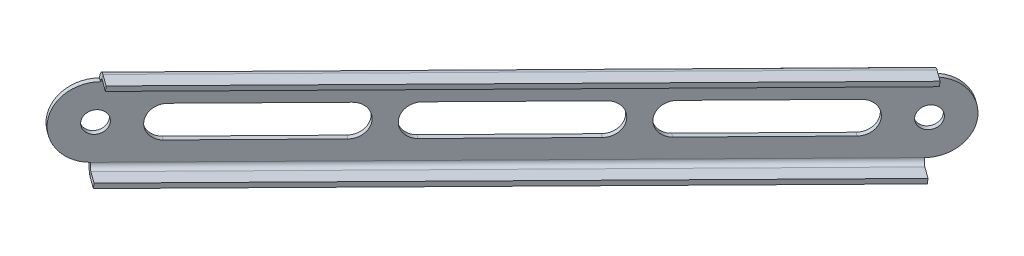
ISO-10303-21;
HEADER;
FILE_DESCRIPTION(('STEP AP214'),'2;1');
FILE_NAME('part.step','',(''),(''),'','','');
FILE_SCHEMA(('AUTOMOTIVE_DESIGN { 1 0 10303 214 1 1 1 1 }'));
ENDSEC;
DATA;
#1=APPLICATION_CONTEXT('core data for automotive mechanical design processes');
#2=APPLICATION_PROTOCOL_DEFINITION('international standard','automotive_design',2000,#1);
#3=PRODUCT_CONTEXT('',#1,'mechanical');
#4=PRODUCT('Part','Part','',(#3));
#5=PRODUCT_RELATED_PRODUCT_CATEGORY('part','',(#4));
#6=PRODUCT_DEFINITION_FORMATION('','',#4);
#7=PRODUCT_DEFINITION_CONTEXT('part definition',#1,'design');
#8=PRODUCT_DEFINITION('design','',#6,#7);
#9=PRODUCT_DEFINITION_SHAPE('','',#8);
#10=(LENGTH_UNIT() NAMED_UNIT(*) SI_UNIT(.MILLI.,.METRE.));
#11=(NAMED_UNIT(*) PLANE_ANGLE_UNIT() SI_UNIT($,.RADIAN.));
#12=(NAMED_UNIT(*) SI_UNIT($,.STERADIAN.) SOLID_ANGLE_UNIT());
#13=UNCERTAINTY_MEASURE_WITH_UNIT(LENGTH_MEASURE(1.E-05),#10,'distance_accuracy_value','');
#14=(GEOMETRIC_REPRESENTATION_CONTEXT(3) GLOBAL_UNCERTAINTY_ASSIGNED_CONTEXT((#13)) GLOBAL_UNIT_ASSIGNED_CONTEXT((#10,
#11,#12)) REPRESENTATION_CONTEXT('',''));
#15=CARTESIAN_POINT('',(0.,0.,0.));
#16=DIRECTION('',(0.,0.,1.));
#17=DIRECTION('',(1.,0.,0.));
#18=AXIS2_PLACEMENT_3D('',#15,#16,#17);
#19=CARTESIAN_POINT('',(46.1946672147795,292.349027374514,185.048223614894));
#20=DIRECTION('',(0.809016994374949,0.,0.587785252292471));
#21=DIRECTION('',(-0.587785252292471,0.,0.809016994374949));
#22=AXIS2_PLACEMENT_3D('',#19,#20,#21);
#23=CYLINDRICAL_SURFACE('',#22,5.00000000000003);
#24=DIRECTION('',(0.809016994374949,0.,0.587785252292471));
#25=VECTOR('',#24,1.);
#26=CARTESIAN_POINT('',(46.4979226401542,297.322337873893,184.630828330124));
#27=LINE('',#26,#25);
#28=CARTESIAN_POINT('',(45.2843971485918,297.322337873893,183.749150451685));
#29=VERTEX_POINT('',#28);
#30=CARTESIAN_POINT('',(46.4979226401542,297.322337873893,184.630828330124));
#31=VERTEX_POINT('',#30);
#32=EDGE_CURVE('E11',#29,#31,#27,.T.);
#33=ORIENTED_EDGE('',*,*,#32,.T.);
#34=CARTESIAN_POINT('',(46.1946672147795,292.349027374514,185.048223614894));
#35=DIRECTION('',(-0.809016994374949,0.,-0.587785252292471));
#36=DIRECTION('',(-0.587785252292471,0.,0.809016994374949));
#37=AXIS2_PLACEMENT_3D('',#34,#35,#36);
#38=CIRCLE('',#37,5.00000000000003);
#39=CARTESIAN_POINT('',(45.8914117894049,287.375716875136,185.465618899665));
#40=VERTEX_POINT('',#39);
#41=EDGE_CURVE('E149',#40,#31,#38,.T.);
#42=ORIENTED_EDGE('',*,*,#41,.F.);
#43=DIRECTION('',(0.809016994374949,0.,0.587785252292471));
#44=VECTOR('',#43,1.);
#45=CARTESIAN_POINT('',(45.8914117894049,287.375716875136,185.465618899665));
#46=LINE('',#45,#44);
#47=CARTESIAN_POINT('',(44.6778862978425,287.375716875136,184.583941021226));
#48=VERTEX_POINT('',#47);
#49=EDGE_CURVE('E44',#48,#40,#46,.T.);
#50=ORIENTED_EDGE('',*,*,#49,.F.);
#51=CARTESIAN_POINT('',(44.9811417232171,292.349027374514,184.166545736456));
#52=DIRECTION('',(-0.809016994374949,0.,-0.587785252292471));
#53=DIRECTION('',(-0.587785252292471,0.,0.809016994374949));
#54=AXIS2_PLACEMENT_3D('',#51,#52,#53);
#55=CIRCLE('',#54,5.00000000000003);
#56=EDGE_CURVE('E109',#48,#29,#55,.T.);
#57=ORIENTED_EDGE('',*,*,#56,.T.);
#58=EDGE_LOOP('',(#33,#42,#50,#57));
#59=FACE_BOUND('',#58,.T.);
#60=ADVANCED_FACE('F34',(#59),#23,.F.);
#61=CARTESIAN_POINT('',(70.4777787273767,283.036413709116,151.62538795617));
#62=DIRECTION('',(0.0606510850749327,0.994662099875776,-0.0834790569540966));
#63=DIRECTION('',(-0.584647713321243,0.10318578909284,0.804698542460175));
#64=AXIS2_PLACEMENT_3D('',#61,#62,#63);
#65=PLANE('',#64);
#66=ORIENTED_EDGE('',*,*,#49,.T.);
#67=DIRECTION('',(-0.584647713321243,0.10318578909284,0.804698542460175));
#68=VECTOR('',#67,1.);
#69=CARTESIAN_POINT('',(70.4777787273767,283.036413709116,151.62538795617));
#70=LINE('',#69,#68);
#71=CARTESIAN_POINT('',(70.4777787273767,283.036413709116,151.62538795617));
#72=VERTEX_POINT('',#71);
#73=EDGE_CURVE('E146',#72,#40,#70,.T.);
#74=ORIENTED_EDGE('',*,*,#73,.F.);
#75=DIRECTION('',(0.809016994374949,0.,0.587785252292471));
#76=VECTOR('',#75,1.);
#77=CARTESIAN_POINT('',(70.4777787273767,283.036413709116,151.62538795617));
#78=LINE('',#77,#76);
#79=CARTESIAN_POINT('',(69.2642532358143,283.036413709116,150.743710077731));
#80=VERTEX_POINT('',#79);
#81=EDGE_CURVE('E120',#80,#72,#78,.T.);
#82=ORIENTED_EDGE('',*,*,#81,.F.);
#83=DIRECTION('',(-0.584647713321243,0.10318578909284,0.804698542460175));
#84=VECTOR('',#83,1.);
#85=CARTESIAN_POINT('',(69.2642532358143,283.036413709116,150.743710077731));
#86=LINE('',#85,#84);
#87=EDGE_CURVE('E114',#80,#48,#86,.T.);
#88=ORIENTED_EDGE('',*,*,#87,.T.);
#89=EDGE_LOOP('',(#66,#74,#82,#88));
#90=FACE_BOUND('',#89,.T.);
#91=ADVANCED_FACE('F145',(#90),#65,.T.);
#92=CARTESIAN_POINT('',(70.7810341527513,288.009724208495,151.2079926714));
#93=DIRECTION('',(0.809016994374949,0.,0.587785252292471));
#94=DIRECTION('',(-0.587785252292471,0.,0.809016994374949));
#95=AXIS2_PLACEMENT_3D('',#92,#93,#94);
#96=CYLINDRICAL_SURFACE('',#95,4.99999999999989);
#97=ORIENTED_EDGE('',*,*,#81,.T.);
#98=CARTESIAN_POINT('',(70.7810341527513,288.009724208495,151.2079926714));
#99=DIRECTION('',(-0.809016994374949,0.,-0.587785252292471));
#100=DIRECTION('',(-0.587785252292471,0.,0.809016994374949));
#101=AXIS2_PLACEMENT_3D('',#98,#99,#100);
#102=CIRCLE('',#101,4.99999999999989);
#103=CARTESIAN_POINT('',(71.084289578126,292.983034707874,150.790597386629));
#104=VERTEX_POINT('',#103);
#105=EDGE_CURVE('E52',#104,#72,#102,.T.);
#106=ORIENTED_EDGE('',*,*,#105,.F.);
#107=DIRECTION('',(0.809016994374949,0.,0.587785252292471));
#108=VECTOR('',#107,1.);
#109=CARTESIAN_POINT('',(71.084289578126,292.983034707874,150.790597386629));
#110=LINE('',#109,#108);
#111=CARTESIAN_POINT('',(69.8707640865636,292.983034707874,149.90891950819));
#112=VERTEX_POINT('',#111);
#113=EDGE_CURVE('E38',#112,#104,#110,.T.);
#114=ORIENTED_EDGE('',*,*,#113,.F.);
#115=CARTESIAN_POINT('',(69.5675086611889,288.009724208495,150.326314792961));
#116=DIRECTION('',(-0.809016994374949,0.,-0.587785252292471));
#117=DIRECTION('',(-0.587785252292471,0.,0.809016994374949));
#118=AXIS2_PLACEMENT_3D('',#115,#116,#117);
#119=CIRCLE('',#118,4.99999999999989);
#120=EDGE_CURVE('E110',#112,#80,#119,.T.);
#121=ORIENTED_EDGE('',*,*,#120,.T.);
#122=EDGE_LOOP('',(#97,#106,#114,#121));
#123=FACE_BOUND('',#122,.T.);
#124=ADVANCED_FACE('F119',(#123),#96,.F.);
#125=CARTESIAN_POINT('',(114.076127917003,280.368475791505,91.6174083691793));
#126=DIRECTION('',(0.809016994374949,0.,0.587785252292471));
#127=DIRECTION('',(-0.587785252292471,0.,0.809016994374949));
#128=AXIS2_PLACEMENT_3D('',#125,#126,#127);
#129=CYLINDRICAL_SURFACE('',#128,5.00000000000003);
#130=DIRECTION('',(0.809016994374949,0.,0.587785252292471));
#131=VECTOR('',#130,1.);
#132=CARTESIAN_POINT('',(114.379383342378,285.341786290884,91.2000130844088));
#133=LINE('',#132,#131);
#134=CARTESIAN_POINT('',(113.165857850815,285.341786290884,90.3183352059701));
#135=VERTEX_POINT('',#134);
#136=CARTESIAN_POINT('',(114.379383342378,285.341786290884,91.2000130844088));
#137=VERTEX_POINT('',#136);
#138=EDGE_CURVE('E121',#135,#137,#133,.T.);
#139=ORIENTED_EDGE('',*,*,#138,.T.);
#140=CARTESIAN_POINT('',(114.076127917003,280.368475791505,91.6174083691793));
#141=DIRECTION('',(-0.809016994374949,0.,-0.587785252292471));
#142=DIRECTION('',(-0.587785252292471,0.,0.809016994374949));
#143=AXIS2_PLACEMENT_3D('',#140,#141,#142);
#144=CIRCLE('',#143,5.00000000000003);
#145=CARTESIAN_POINT('',(113.772872491628,275.395165292126,92.0348036539498));
#146=VERTEX_POINT('',#145);
#147=EDGE_CURVE('E238',#146,#137,#144,.T.);
#148=ORIENTED_EDGE('',*,*,#147,.F.);
#149=DIRECTION('',(0.809016994374949,0.,0.587785252292471));
#150=VECTOR('',#149,1.);
#151=CARTESIAN_POINT('',(113.772872491628,275.395165292126,92.0348036539498));
#152=LINE('',#151,#150);
#153=CARTESIAN_POINT('',(112.559347000066,275.395165292126,91.1531257755111));
#154=VERTEX_POINT('',#153);
#155=EDGE_CURVE('E124',#154,#146,#152,.T.);
#156=ORIENTED_EDGE('',*,*,#155,.F.);
#157=CARTESIAN_POINT('',(112.86260242544,280.368475791505,90.7357304907406));
#158=DIRECTION('',(-0.809016994374949,0.,-0.587785252292471));
#159=DIRECTION('',(-0.587785252292471,0.,0.809016994374949));
#160=AXIS2_PLACEMENT_3D('',#157,#158,#159);
#161=CIRCLE('',#160,5.00000000000003);
#162=EDGE_CURVE('E189',#154,#135,#161,.T.);
#163=ORIENTED_EDGE('',*,*,#162,.T.);
#164=EDGE_LOOP('',(#139,#148,#156,#163));
#165=FACE_BOUND('',#164,.T.);
#166=ADVANCED_FACE('F464',(#165),#129,.F.);
#167=CARTESIAN_POINT('',(138.3592394296,271.055862126107,58.1945727104551));
#168=DIRECTION('',(0.060651085074935,0.994662099875775,-0.0834790569540998));
#169=DIRECTION('',(-0.584647713321242,0.103185789092844,0.804698542460175));
#170=AXIS2_PLACEMENT_3D('',#167,#168,#169);
#171=PLANE('',#170);
#172=ORIENTED_EDGE('',*,*,#155,.T.);
#173=DIRECTION('',(-0.584647713321242,0.103185789092844,0.804698542460175));
#174=VECTOR('',#173,1.);
#175=CARTESIAN_POINT('',(138.3592394296,271.055862126107,58.1945727104551));
#176=LINE('',#175,#174);
#177=CARTESIAN_POINT('',(138.3592394296,271.055862126107,58.1945727104551));
#178=VERTEX_POINT('',#177);
#179=EDGE_CURVE('E233',#178,#146,#176,.T.);
#180=ORIENTED_EDGE('',*,*,#179,.F.);
#181=DIRECTION('',(0.809016994374949,0.,0.587785252292471));
#182=VECTOR('',#181,1.);
#183=CARTESIAN_POINT('',(138.3592394296,271.055862126107,58.1945727104551));
#184=LINE('',#183,#182);
#185=CARTESIAN_POINT('',(137.145713938038,271.055862126107,57.3128948320164));
#186=VERTEX_POINT('',#185);
#187=EDGE_CURVE('E132',#186,#178,#184,.T.);
#188=ORIENTED_EDGE('',*,*,#187,.F.);
#189=DIRECTION('',(-0.584647713321242,0.103185789092844,0.804698542460175));
#190=VECTOR('',#189,1.);
#191=CARTESIAN_POINT('',(137.145713938038,271.055862126107,57.3128948320164));
#192=LINE('',#191,#190);
#193=EDGE_CURVE('E117',#186,#154,#192,.T.);
#194=ORIENTED_EDGE('',*,*,#193,.T.);
#195=EDGE_LOOP('',(#172,#180,#188,#194));
#196=FACE_BOUND('',#195,.T.);
#197=ADVANCED_FACE('F234',(#196),#171,.T.);
#198=CARTESIAN_POINT('',(138.662494854975,276.029172625486,57.7771774256846));
#199=DIRECTION('',(0.809016994374949,0.,0.587785252292471));
#200=DIRECTION('',(-0.587785252292471,0.,0.809016994374949));
#201=AXIS2_PLACEMENT_3D('',#198,#199,#200);
#202=CYLINDRICAL_SURFACE('',#201,5.00000000000006);
#203=ORIENTED_EDGE('',*,*,#187,.T.);
#204=CARTESIAN_POINT('',(138.662494854975,276.029172625486,57.7771774256846));
#205=DIRECTION('',(-0.809016994374949,0.,-0.587785252292471));
#206=DIRECTION('',(-0.587785252292471,0.,0.809016994374949));
#207=AXIS2_PLACEMENT_3D('',#204,#205,#206);
#208=CIRCLE('',#207,5.00000000000006);
#209=CARTESIAN_POINT('',(138.965750280349,281.002483124865,57.3597821409141));
#210=VERTEX_POINT('',#209);
#211=EDGE_CURVE('E226',#210,#178,#208,.T.);
#212=ORIENTED_EDGE('',*,*,#211,.F.);
#213=DIRECTION('',(0.809016994374949,0.,0.587785252292471));
#214=VECTOR('',#213,1.);
#215=CARTESIAN_POINT('',(138.965750280349,281.002483124865,57.3597821409141));
#216=LINE('',#215,#214);
#217=CARTESIAN_POINT('',(137.752224788787,281.002483124865,56.4781042624754));
#218=VERTEX_POINT('',#217);
#219=EDGE_CURVE('E136',#218,#210,#216,.T.);
#220=ORIENTED_EDGE('',*,*,#219,.F.);
#221=CARTESIAN_POINT('',(137.448969363412,276.029172625486,56.8954995472459));
#222=DIRECTION('',(-0.809016994374949,0.,-0.587785252292471));
#223=DIRECTION('',(-0.587785252292471,0.,0.809016994374949));
#224=AXIS2_PLACEMENT_3D('',#221,#222,#223);
#225=CIRCLE('',#224,5.00000000000006);
#226=EDGE_CURVE('E185',#218,#186,#225,.T.);
#227=ORIENTED_EDGE('',*,*,#226,.T.);
#228=EDGE_LOOP('',(#203,#212,#220,#227));
#229=FACE_BOUND('',#228,.T.);
#230=ADVANCED_FACE('F222',(#229),#202,.F.);
#231=CARTESIAN_POINT('',(148.016858268115,274.3782,44.9020007463218));
#232=DIRECTION('',(0.809016994374949,0.,0.587785252292471));
#233=DIRECTION('',(-0.587785252292471,0.,0.809016994374949));
#234=AXIS2_PLACEMENT_3D('',#231,#232,#233);
#235=CYLINDRICAL_SURFACE('',#234,11.);
#236=DIRECTION('',(0.809016994374949,0.,0.587785252292471));
#237=VECTOR('',#236,1.);
#238=CARTESIAN_POINT('',(148.684020203939,285.319483098633,43.9837311198267));
#239=LINE('',#238,#237);
#240=CARTESIAN_POINT('',(147.470494712377,285.319483098635,43.1020532413885));
#241=VERTEX_POINT('',#240);
#242=CARTESIAN_POINT('',(148.684020203939,285.319483098633,43.9837311198267));
#243=VERTEX_POINT('',#242);
#244=EDGE_CURVE('E138',#241,#243,#239,.T.);
#245=ORIENTED_EDGE('',*,*,#244,.T.);
#246=CARTESIAN_POINT('',(148.016858268115,274.3782,44.9020007463218));
#247=DIRECTION('',(-0.809016994374949,0.,-0.587785252292471));
#248=DIRECTION('',(-0.587785252292471,0.,0.809016994374949));
#249=AXIS2_PLACEMENT_3D('',#246,#247,#248);
#250=CIRCLE('',#249,11.);
#251=CARTESIAN_POINT('',(147.34969633229,263.436916901366,45.8202703728169));
#252=VERTEX_POINT('',#251);
#253=EDGE_CURVE('E252',#243,#252,#250,.T.);
#254=ORIENTED_EDGE('',*,*,#253,.T.);
#255=DIRECTION('',(0.809016994374949,0.,0.587785252292471));
#256=VECTOR('',#255,1.);
#257=CARTESIAN_POINT('',(147.34969633229,263.436916901366,45.8202703728169));
#258=LINE('',#257,#256);
#259=CARTESIAN_POINT('',(146.136170840728,263.436916901366,44.9385924943781));
#260=VERTEX_POINT('',#259);
#261=EDGE_CURVE('E210',#260,#252,#258,.T.);
#262=ORIENTED_EDGE('',*,*,#261,.F.);
#263=CARTESIAN_POINT('',(146.803332776552,274.3782,44.0203228678831));
#264=DIRECTION('',(-0.809016994374949,0.,-0.587785252292471));
#265=DIRECTION('',(-0.587785252292471,0.,0.809016994374949));
#266=AXIS2_PLACEMENT_3D('',#263,#264,#265);
#267=CIRCLE('',#266,11.);
#268=EDGE_CURVE('E178',#241,#260,#267,.T.);
#269=ORIENTED_EDGE('',*,*,#268,.F.);
#270=EDGE_LOOP('',(#245,#254,#262,#269));
#271=FACE_BOUND('',#270,.T.);
#272=ADVANCED_FACE('F475',(#271),#235,.T.);
#273=CARTESIAN_POINT('',(36.8403038016397,294.,197.923400294257));
#274=DIRECTION('',(0.809016994374949,0.,0.587785252292471));
#275=DIRECTION('',(-0.587785252292471,0.,0.809016994374949));
#276=AXIS2_PLACEMENT_3D('',#273,#274,#275);
#277=CYLINDRICAL_SURFACE('',#276,11.);
#278=DIRECTION('',(0.809016994374949,0.,0.587785252292471));
#279=VECTOR('',#278,1.);
#280=CARTESIAN_POINT('',(36.1731418658154,283.058716901366,198.841669920752));
#281=LINE('',#280,#279);
#282=CARTESIAN_POINT('',(34.9596163742536,283.058716901366,197.959992042314));
#283=VERTEX_POINT('',#282);
#284=CARTESIAN_POINT('',(36.1731418658154,283.058716901366,198.841669920752));
#285=VERTEX_POINT('',#284);
#286=EDGE_CURVE('E207',#283,#285,#281,.T.);
#287=ORIENTED_EDGE('',*,*,#286,.T.);
#288=CARTESIAN_POINT('',(36.8403038016397,294.,197.923400294257));
#289=DIRECTION('',(-0.809016994374949,0.,-0.587785252292471));
#290=DIRECTION('',(0.587785252292471,0.,-0.809016994374949));
#291=AXIS2_PLACEMENT_3D('',#288,#289,#290);
#292=CIRCLE('',#291,11.);
#293=CARTESIAN_POINT('',(37.507465737464,304.941283098634,197.005130667762));
#294=VERTEX_POINT('',#293);
#295=EDGE_CURVE('E258',#285,#294,#292,.T.);
#296=ORIENTED_EDGE('',*,*,#295,.T.);
#297=DIRECTION('',(0.809016994374949,0.,0.587785252292471));
#298=VECTOR('',#297,1.);
#299=CARTESIAN_POINT('',(37.507465737464,304.941283098634,197.005130667762));
#300=LINE('',#299,#298);
#301=CARTESIAN_POINT('',(36.2939402459015,304.941283098634,196.123452789323));
#302=VERTEX_POINT('',#301);
#303=EDGE_CURVE('E204',#302,#294,#300,.T.);
#304=ORIENTED_EDGE('',*,*,#303,.F.);
#305=CARTESIAN_POINT('',(35.6267783100772,294.,197.041722415818));
#306=DIRECTION('',(-0.809016994374949,0.,-0.587785252292471));
#307=DIRECTION('',(-0.587785252292471,0.,0.809016994374949));
#308=AXIS2_PLACEMENT_3D('',#305,#306,#307);
#309=CIRCLE('',#308,11.);
#310=EDGE_CURVE('E170',#283,#302,#309,.T.);
#311=ORIENTED_EDGE('',*,*,#310,.F.);
#312=EDGE_LOOP('',(#287,#296,#304,#311));
#313=FACE_BOUND('',#312,.T.);
#314=ADVANCED_FACE('F482',(#313),#277,.T.);
#315=CARTESIAN_POINT('',(80.1353975658912,286.35875158301,138.332815992037));
#316=DIRECTION('',(0.809016994374949,0.,0.587785252292471));
#317=DIRECTION('',(-0.587785252292471,0.,0.809016994374949));
#318=AXIS2_PLACEMENT_3D('',#315,#316,#317);
#319=CYLINDRICAL_SURFACE('',#318,5.00000000000009);
#320=DIRECTION('',(0.809016994374949,0.,0.587785252292471));
#321=VECTOR('',#320,1.);
#322=CARTESIAN_POINT('',(80.4386529912658,291.332062082389,137.915420707266));
#323=LINE('',#322,#321);
#324=CARTESIAN_POINT('',(79.2251274997034,291.332062082389,137.033742828828));
#325=VERTEX_POINT('',#324);
#326=CARTESIAN_POINT('',(80.4386529912658,291.332062082389,137.915420707266));
#327=VERTEX_POINT('',#326);
#328=EDGE_CURVE('E201',#325,#327,#323,.T.);
#329=ORIENTED_EDGE('',*,*,#328,.T.);
#330=CARTESIAN_POINT('',(80.1353975658912,286.35875158301,138.332815992037));
#331=DIRECTION('',(-0.809016994374949,0.,-0.587785252292471));
#332=DIRECTION('',(-0.587785252292471,0.,0.809016994374949));
#333=AXIS2_PLACEMENT_3D('',#330,#331,#332);
#334=CIRCLE('',#333,5.00000000000009);
#335=CARTESIAN_POINT('',(79.8321421405165,281.385441083631,138.750211276807));
#336=VERTEX_POINT('',#335);
#337=EDGE_CURVE('E267',#336,#327,#334,.T.);
#338=ORIENTED_EDGE('',*,*,#337,.F.);
#339=DIRECTION('',(0.809016994374949,0.,0.587785252292471));
#340=VECTOR('',#339,1.);
#341=CARTESIAN_POINT('',(79.8321421405165,281.385441083631,138.750211276807));
#342=LINE('',#341,#340);
#343=CARTESIAN_POINT('',(78.6186166489541,281.385441083631,137.868533398369));
#344=VERTEX_POINT('',#343);
#345=EDGE_CURVE('E198',#344,#336,#342,.T.);
#346=ORIENTED_EDGE('',*,*,#345,.F.);
#347=CARTESIAN_POINT('',(78.9218720743288,286.35875158301,137.451138113598));
#348=DIRECTION('',(-0.809016994374949,0.,-0.587785252292471));
#349=DIRECTION('',(-0.587785252292471,0.,0.809016994374949));
#350=AXIS2_PLACEMENT_3D('',#347,#348,#349);
#351=CIRCLE('',#350,5.00000000000009);
#352=EDGE_CURVE('E164',#344,#325,#351,.T.);
#353=ORIENTED_EDGE('',*,*,#352,.T.);
#354=EDGE_LOOP('',(#329,#338,#346,#353));
#355=FACE_BOUND('',#354,.T.);
#356=ADVANCED_FACE('F486',(#355),#319,.F.);
#357=CARTESIAN_POINT('',(104.418509078488,277.046137917611,104.909980333313));
#358=DIRECTION('',(0.060651085074935,0.994662099875776,-0.0834790569540998));
#359=DIRECTION('',(-0.584647713321242,0.103185789092844,0.804698542460175));
#360=AXIS2_PLACEMENT_3D('',#357,#358,#359);
#361=PLANE('',#360);
#362=ORIENTED_EDGE('',*,*,#345,.T.);
#363=DIRECTION('',(-0.584647713321242,0.103185789092844,0.804698542460175));
#364=VECTOR('',#363,1.);
#365=CARTESIAN_POINT('',(104.418509078488,277.046137917611,104.909980333313));
#366=LINE('',#365,#364);
#367=CARTESIAN_POINT('',(104.418509078488,277.046137917611,104.909980333313));
#368=VERTEX_POINT('',#367);
#369=EDGE_CURVE('E264',#368,#336,#366,.T.);
#370=ORIENTED_EDGE('',*,*,#369,.F.);
#371=DIRECTION('',(0.809016994374949,0.,0.587785252292471));
#372=VECTOR('',#371,1.);
#373=CARTESIAN_POINT('',(104.418509078488,277.046137917611,104.909980333313));
#374=LINE('',#373,#372);
#375=CARTESIAN_POINT('',(103.204983586926,277.046137917611,104.028302454874));
#376=VERTEX_POINT('',#375);
#377=EDGE_CURVE('E195',#376,#368,#374,.T.);
#378=ORIENTED_EDGE('',*,*,#377,.F.);
#379=DIRECTION('',(-0.584647713321242,0.103185789092844,0.804698542460175));
#380=VECTOR('',#379,1.);
#381=CARTESIAN_POINT('',(103.204983586926,277.046137917611,104.028302454874));
#382=LINE('',#381,#380);
#383=EDGE_CURVE('E161',#376,#344,#382,.T.);
#384=ORIENTED_EDGE('',*,*,#383,.T.);
#385=EDGE_LOOP('',(#362,#370,#378,#384));
#386=FACE_BOUND('',#385,.T.);
#387=ADVANCED_FACE('F498',(#386),#361,.T.);
#388=CARTESIAN_POINT('',(104.721764503863,282.01944841699,104.492585048542));
#389=DIRECTION('',(0.809016994374949,0.,0.587785252292471));
#390=DIRECTION('',(-0.587785252292471,0.,0.809016994374949));
#391=AXIS2_PLACEMENT_3D('',#388,#389,#390);
#392=CYLINDRICAL_SURFACE('',#391,5.00000000000011);
#393=ORIENTED_EDGE('',*,*,#377,.T.);
#394=CARTESIAN_POINT('',(104.721764503863,282.01944841699,104.492585048542));
#395=DIRECTION('',(-0.809016994374949,0.,-0.587785252292471));
#396=DIRECTION('',(-0.587785252292471,0.,0.809016994374949));
#397=AXIS2_PLACEMENT_3D('',#394,#395,#396);
#398=CIRCLE('',#397,5.00000000000011);
#399=CARTESIAN_POINT('',(105.025019929238,286.992758916369,104.075189763772));
#400=VERTEX_POINT('',#399);
#401=EDGE_CURVE('E193',#400,#368,#398,.T.);
#402=ORIENTED_EDGE('',*,*,#401,.F.);
#403=DIRECTION('',(0.809016994374949,0.,0.587785252292471));
#404=VECTOR('',#403,1.);
#405=CARTESIAN_POINT('',(105.025019929238,286.992758916369,104.075189763772));
#406=LINE('',#405,#404);
#407=CARTESIAN_POINT('',(103.811494437675,286.992758916369,103.193511885333));
#408=VERTEX_POINT('',#407);
#409=EDGE_CURVE('E152',#408,#400,#406,.T.);
#410=ORIENTED_EDGE('',*,*,#409,.F.);
#411=CARTESIAN_POINT('',(103.508239012301,282.01944841699,103.610907170103));
#412=DIRECTION('',(-0.809016994374949,0.,-0.587785252292471));
#413=DIRECTION('',(-0.587785252292471,0.,0.809016994374949));
#414=AXIS2_PLACEMENT_3D('',#411,#412,#413);
#415=CIRCLE('',#414,5.00000000000011);
#416=EDGE_CURVE('E157',#408,#376,#415,.T.);
#417=ORIENTED_EDGE('',*,*,#416,.T.);
#418=EDGE_LOOP('',(#393,#402,#410,#417));
#419=FACE_BOUND('',#418,.T.);
#420=ADVANCED_FACE('F494',(#419),#392,.F.);
#421=CARTESIAN_POINT('',(105.025019929238,286.992758916369,104.075189763772));
#422=DIRECTION('',(-0.0606510850749342,-0.994662099875776,0.0834790569540987));
#423=DIRECTION('',(0.584647713321242,-0.103185789092842,-0.804698542460175));
#424=AXIS2_PLACEMENT_3D('',#421,#422,#423);
#425=PLANE('',#424);
#426=DIRECTION('',(0.584647713321242,-0.103185789092842,-0.804698542460175));
#427=VECTOR('',#426,1.);
#428=CARTESIAN_POINT('',(103.811494437675,286.992758916369,103.193511885333));
#429=LINE('',#428,#427);
#430=EDGE_CURVE('E159',#325,#408,#429,.T.);
#431=ORIENTED_EDGE('',*,*,#430,.T.);
#432=ORIENTED_EDGE('',*,*,#409,.T.);
#433=DIRECTION('',(0.584647713321242,-0.103185789092842,-0.804698542460175));
#434=VECTOR('',#433,1.);
#435=CARTESIAN_POINT('',(105.025019929238,286.992758916369,104.075189763772));
#436=LINE('',#435,#434);
#437=EDGE_CURVE('E270',#327,#400,#436,.T.);
#438=ORIENTED_EDGE('',*,*,#437,.F.);
#439=ORIENTED_EDGE('',*,*,#328,.F.);
#440=EDGE_LOOP('',(#431,#432,#438,#439));
#441=FACE_BOUND('',#440,.T.);
#442=ADVANCED_FACE('F490',(#441),#425,.T.);
#443=CARTESIAN_POINT('',(148.016858268115,274.3782,44.9020007463218));
#444=DIRECTION('',(0.809016994374949,0.,0.587785252292471));
#445=DIRECTION('',(-0.587785252292471,0.,0.809016994374949));
#446=AXIS2_PLACEMENT_3D('',#443,#444,#445);
#447=CYLINDRICAL_SURFACE('',#446,3.37820000000001);
#448=CARTESIAN_POINT('',(148.016858268115,274.3782,44.9020007463218));
#449=DIRECTION('',(-0.809016994374949,0.,-0.587785252292471));
#450=DIRECTION('',(-0.587785252292471,0.,0.809016994374949));
#451=AXIS2_PLACEMENT_3D('',#448,#449,#450);
#452=CIRCLE('',#451,3.37820000000001);
#453=CARTESIAN_POINT('',(146.03120212882,274.3782,47.6350219567192));
#454=VERTEX_POINT('',#453);
#455=EDGE_CURVE('E261',#454,#454,#452,.T.);
#456=ORIENTED_EDGE('',*,*,#455,.F.);
#457=EDGE_LOOP('',(#456));
#458=FACE_BOUND('',#457,.T.);
#459=CARTESIAN_POINT('',(146.803332776552,274.3782,44.0203228678831));
#460=DIRECTION('',(-0.809016994374949,0.,-0.587785252292471));
#461=DIRECTION('',(-0.587785252292471,0.,0.809016994374949));
#462=AXIS2_PLACEMENT_3D('',#459,#460,#461);
#463=CIRCLE('',#462,3.37820000000001);
#464=CARTESIAN_POINT('',(144.817676637258,274.3782,46.7533440782805));
#465=VERTEX_POINT('',#464);
#466=EDGE_CURVE('E163',#465,#465,#463,.T.);
#467=ORIENTED_EDGE('',*,*,#466,.T.);
#468=EDGE_LOOP('',(#467));
#469=FACE_BOUND('',#468,.T.);
#470=ADVANCED_FACE('F478',(#458,#469),#447,.F.);
#471=CARTESIAN_POINT('',(36.8403038016397,294.,197.923400294257));
#472=DIRECTION('',(0.809016994374949,0.,0.587785252292471));
#473=DIRECTION('',(-0.587785252292471,0.,0.809016994374949));
#474=AXIS2_PLACEMENT_3D('',#471,#472,#473);
#475=CYLINDRICAL_SURFACE('',#474,3.37819999999997);
#476=CARTESIAN_POINT('',(36.8403038016397,294.,197.923400294257));
#477=DIRECTION('',(-0.809016994374949,0.,-0.587785252292471));
#478=DIRECTION('',(-0.587785252292471,0.,0.809016994374949));
#479=AXIS2_PLACEMENT_3D('',#476,#477,#478);
#480=CIRCLE('',#479,3.37819999999997);
#481=CARTESIAN_POINT('',(34.8546476623453,294.,200.656421504655));
#482=VERTEX_POINT('',#481);
#483=EDGE_CURVE('E246',#482,#482,#480,.T.);
#484=ORIENTED_EDGE('',*,*,#483,.F.);
#485=EDGE_LOOP('',(#484));
#486=FACE_BOUND('',#485,.T.);
#487=CARTESIAN_POINT('',(35.6267783100772,294.,197.041722415818));
#488=DIRECTION('',(-0.809016994374949,0.,-0.587785252292471));
#489=DIRECTION('',(-0.587785252292471,0.,0.809016994374949));
#490=AXIS2_PLACEMENT_3D('',#487,#488,#489);
#491=CIRCLE('',#490,3.37819999999997);
#492=CARTESIAN_POINT('',(33.6411221707828,294.,199.774743626216));
#493=VERTEX_POINT('',#492);
#494=EDGE_CURVE('E177',#493,#493,#491,.T.);
#495=ORIENTED_EDGE('',*,*,#494,.T.);
#496=EDGE_LOOP('',(#495));
#497=FACE_BOUND('',#496,.T.);
#498=ADVANCED_FACE('F467',(#486,#497),#475,.F.);
#499=CARTESIAN_POINT('',(138.965750280349,281.002483124865,57.3597821409141));
#500=DIRECTION('',(-0.0606510850749342,-0.994662099875776,0.0834790569540987));
#501=DIRECTION('',(0.584647713321242,-0.103185789092842,-0.804698542460175));
#502=AXIS2_PLACEMENT_3D('',#499,#500,#501);
#503=PLANE('',#502);
#504=DIRECTION('',(0.584647713321242,-0.103185789092842,-0.804698542460175));
#505=VECTOR('',#504,1.);
#506=CARTESIAN_POINT('',(137.752224788787,281.002483124865,56.4781042624754));
#507=LINE('',#506,#505);
#508=EDGE_CURVE('E187',#135,#218,#507,.T.);
#509=ORIENTED_EDGE('',*,*,#508,.T.);
#510=ORIENTED_EDGE('',*,*,#219,.T.);
#511=DIRECTION('',(0.584647713321242,-0.103185789092842,-0.804698542460175));
#512=VECTOR('',#511,1.);
#513=CARTESIAN_POINT('',(138.965750280349,281.002483124865,57.3597821409141));
#514=LINE('',#513,#512);
#515=EDGE_CURVE('E240',#137,#210,#514,.T.);
#516=ORIENTED_EDGE('',*,*,#515,.F.);
#517=ORIENTED_EDGE('',*,*,#138,.F.);
#518=EDGE_LOOP('',(#509,#510,#516,#517));
#519=FACE_BOUND('',#518,.T.);
#520=ADVANCED_FACE('F453',(#519),#503,.T.);
#521=CARTESIAN_POINT('',(71.084289578126,292.983034707874,150.790597386629));
#522=DIRECTION('',(-0.0606510850749366,-0.994662099875775,0.083479056954102));
#523=DIRECTION('',(0.584647713321242,-0.103185789092846,-0.804698542460174));
#524=AXIS2_PLACEMENT_3D('',#521,#522,#523);
#525=PLANE('',#524);
#526=DIRECTION('',(0.584647713321242,-0.103185789092846,-0.804698542460174));
#527=VECTOR('',#526,1.);
#528=CARTESIAN_POINT('',(69.8707640865636,292.983034707874,149.90891950819));
#529=LINE('',#528,#527);
#530=EDGE_CURVE('E101',#29,#112,#529,.T.);
#531=ORIENTED_EDGE('',*,*,#530,.T.);
#532=ORIENTED_EDGE('',*,*,#113,.T.);
#533=DIRECTION('',(0.584647713321242,-0.103185789092846,-0.804698542460174));
#534=VECTOR('',#533,1.);
#535=CARTESIAN_POINT('',(71.084289578126,292.983034707874,150.790597386629));
#536=LINE('',#535,#534);
#537=EDGE_CURVE('E150',#31,#104,#536,.T.);
#538=ORIENTED_EDGE('',*,*,#537,.F.);
#539=ORIENTED_EDGE('',*,*,#32,.F.);
#540=EDGE_LOOP('',(#531,#532,#538,#539));
#541=FACE_BOUND('',#540,.T.);
#542=ADVANCED_FACE('F36',(#541),#525,.T.);
#543=CARTESIAN_POINT('',(36.8403038016397,294.,197.923400294257));
#544=DIRECTION('',(-0.809016994374949,0.,-0.587785252292471));
#545=DIRECTION('',(0.587785252292471,0.,-0.809016994374949));
#546=AXIS2_PLACEMENT_3D('',#543,#544,#545);
#547=PLANE('',#546);
#548=ORIENTED_EDGE('',*,*,#401,.T.);
#549=ORIENTED_EDGE('',*,*,#369,.T.);
#550=ORIENTED_EDGE('',*,*,#337,.T.);
#551=ORIENTED_EDGE('',*,*,#437,.T.);
#552=EDGE_LOOP('',(#548,#549,#550,#551));
#553=FACE_BOUND('',#552,.T.);
#554=ORIENTED_EDGE('',*,*,#455,.T.);
#555=EDGE_LOOP('',(#554));
#556=FACE_BOUND('',#555,.T.);
#557=ORIENTED_EDGE('',*,*,#295,.F.);
#558=DIRECTION('',(-0.584647713321242,0.103185789092844,0.804698542460175));
#559=VECTOR('',#558,1.);
#560=CARTESIAN_POINT('',(36.1731418658154,283.058716901366,198.841669920752));
#561=LINE('',#560,#559);
#562=EDGE_CURVE('E249',#252,#285,#561,.T.);
#563=ORIENTED_EDGE('',*,*,#562,.F.);
#564=ORIENTED_EDGE('',*,*,#253,.F.);
#565=DIRECTION('',(0.584647713321242,-0.103185789092844,-0.804698542460175));
#566=VECTOR('',#565,1.);
#567=CARTESIAN_POINT('',(148.684020203939,285.319483098633,43.9837311198267));
#568=LINE('',#567,#566);
#569=EDGE_CURVE('E255',#294,#243,#568,.T.);
#570=ORIENTED_EDGE('',*,*,#569,.F.);
#571=EDGE_LOOP('',(#557,#563,#564,#570));
#572=FACE_BOUND('',#571,.T.);
#573=ORIENTED_EDGE('',*,*,#483,.T.);
#574=EDGE_LOOP('',(#573));
#575=FACE_BOUND('',#574,.T.);
#576=ORIENTED_EDGE('',*,*,#211,.T.);
#577=ORIENTED_EDGE('',*,*,#179,.T.);
#578=ORIENTED_EDGE('',*,*,#147,.T.);
#579=ORIENTED_EDGE('',*,*,#515,.T.);
#580=EDGE_LOOP('',(#576,#577,#578,#579));
#581=FACE_BOUND('',#580,.T.);
#582=ORIENTED_EDGE('',*,*,#105,.T.);
#583=ORIENTED_EDGE('',*,*,#73,.T.);
#584=ORIENTED_EDGE('',*,*,#41,.T.);
#585=ORIENTED_EDGE('',*,*,#537,.T.);
#586=EDGE_LOOP('',(#582,#583,#584,#585));
#587=FACE_BOUND('',#586,.T.);
#588=ADVANCED_FACE('F442',(#553,#556,#572,#575,#581,#587),#547,.F.);
#589=CARTESIAN_POINT('',(35.6267783100772,294.,197.041722415818));
#590=DIRECTION('',(-0.809016994374949,0.,-0.587785252292471));
#591=DIRECTION('',(0.587785252292471,0.,-0.809016994374949));
#592=AXIS2_PLACEMENT_3D('',#589,#590,#591);
#593=PLANE('',#592);
#594=ORIENTED_EDGE('',*,*,#416,.F.);
#595=ORIENTED_EDGE('',*,*,#430,.F.);
#596=ORIENTED_EDGE('',*,*,#352,.F.);
#597=ORIENTED_EDGE('',*,*,#383,.F.);
#598=EDGE_LOOP('',(#594,#595,#596,#597));
#599=FACE_BOUND('',#598,.T.);
#600=ORIENTED_EDGE('',*,*,#466,.F.);
#601=EDGE_LOOP('',(#600));
#602=FACE_BOUND('',#601,.T.);
#603=ORIENTED_EDGE('',*,*,#310,.T.);
#604=DIRECTION('',(0.584647713321242,-0.103185789092844,-0.804698542460175));
#605=VECTOR('',#604,1.);
#606=CARTESIAN_POINT('',(147.470494712376,285.319483098633,43.102053241388));
#607=LINE('',#606,#605);
#608=EDGE_CURVE('E173',#302,#241,#607,.T.);
#609=ORIENTED_EDGE('',*,*,#608,.T.);
#610=ORIENTED_EDGE('',*,*,#268,.T.);
#611=DIRECTION('',(-0.584647713321242,0.103185789092844,0.804698542460175));
#612=VECTOR('',#611,1.);
#613=CARTESIAN_POINT('',(34.9596163742529,283.058716901366,197.959992042314));
#614=LINE('',#613,#612);
#615=EDGE_CURVE('E174',#260,#283,#614,.T.);
#616=ORIENTED_EDGE('',*,*,#615,.T.);
#617=EDGE_LOOP('',(#603,#609,#610,#616));
#618=FACE_BOUND('',#617,.T.);
#619=ORIENTED_EDGE('',*,*,#494,.F.);
#620=EDGE_LOOP('',(#619));
#621=FACE_BOUND('',#620,.T.);
#622=ORIENTED_EDGE('',*,*,#226,.F.);
#623=ORIENTED_EDGE('',*,*,#508,.F.);
#624=ORIENTED_EDGE('',*,*,#162,.F.);
#625=ORIENTED_EDGE('',*,*,#193,.F.);
#626=EDGE_LOOP('',(#622,#623,#624,#625));
#627=FACE_BOUND('',#626,.T.);
#628=ORIENTED_EDGE('',*,*,#120,.F.);
#629=ORIENTED_EDGE('',*,*,#530,.F.);
#630=ORIENTED_EDGE('',*,*,#56,.F.);
#631=ORIENTED_EDGE('',*,*,#87,.F.);
#632=EDGE_LOOP('',(#628,#629,#630,#631));
#633=FACE_BOUND('',#632,.T.);
#634=ADVANCED_FACE('F113',(#599,#602,#618,#621,#627,#633),#593,.T.);
#635=CARTESIAN_POINT('',(38.7209912290266,304.941283098635,197.886808546201));
#636=DIRECTION('',(-0.58464771332124,0.103185789092858,0.804698542460175));
#637=DIRECTION('',(-0.809016994374949,0.,-0.58778525229247));
#638=AXIS2_PLACEMENT_3D('',#635,#636,#637);
#639=PLANE('',#638);
#640=DIRECTION('',(-0.0606510850749274,-0.994662099875775,0.0834790569541056));
#641=VECTOR('',#640,1.);
#642=CARTESIAN_POINT('',(38.9029444842512,307.925269398261,197.636371375338));
#643=LINE('',#642,#641);
#644=CARTESIAN_POINT('',(38.8119678566389,306.433276248447,197.76158996077));
#645=VERTEX_POINT('',#644);
#646=CARTESIAN_POINT('',(38.9029444842513,307.925269398261,197.636371375339));
#647=VERTEX_POINT('',#646);
#648=EDGE_CURVE('E287',#645,#647,#643,.F.);
#649=ORIENTED_EDGE('',*,*,#648,.T.);
#650=CARTESIAN_POINT('',(38.7209912290265,304.941283098635,197.886808546201));
#651=DIRECTION('',(-0.58464771332124,0.103185789092858,0.804698542460175));
#652=DIRECTION('',(0.809016994374949,0.,0.58778525229247));
#653=AXIS2_PLACEMENT_3D('',#650,#651,#652);
#654=CIRCLE('',#653,2.9999999999988);
#655=EDGE_CURVE('E160',#302,#647,#654,.F.);
#656=ORIENTED_EDGE('',*,*,#655,.F.);
#657=ORIENTED_EDGE('',*,*,#303,.T.);
#658=CARTESIAN_POINT('',(38.7209912290266,304.941283098635,197.886808546201));
#659=DIRECTION('',(-0.58464771332124,0.103185789092858,0.804698542460175));
#660=DIRECTION('',(0.809016994374949,0.,0.58778525229247));
#661=AXIS2_PLACEMENT_3D('',#658,#659,#660);
#662=CIRCLE('',#661,1.4999999999988);
#663=EDGE_CURVE('E278',#294,#645,#662,.F.);
#664=ORIENTED_EDGE('',*,*,#663,.T.);
#665=EDGE_LOOP('',(#649,#656,#657,#664));
#666=FACE_BOUND('',#665,.T.);
#667=ADVANCED_FACE('F450',(#666),#639,.T.);
#668=CARTESIAN_POINT('',(149.897545695501,285.319483098632,44.8654089982655));
#669=DIRECTION('',(-0.58464771332124,0.103185789092858,0.804698542460175));
#670=DIRECTION('',(-0.809016994374949,0.,-0.58778525229247));
#671=AXIS2_PLACEMENT_3D('',#668,#669,#670);
#672=PLANE('',#671);
#673=CARTESIAN_POINT('',(149.897545695501,285.319483098632,44.8654089982655));
#674=DIRECTION('',(-0.58464771332124,0.103185789092858,0.804698542460175));
#675=DIRECTION('',(0.809016994374949,0.,0.58778525229247));
#676=AXIS2_PLACEMENT_3D('',#673,#674,#675);
#677=CIRCLE('',#676,1.4999999999988);
#678=CARTESIAN_POINT('',(149.988522323113,286.811476248445,44.7401904128344));
#679=VERTEX_POINT('',#678);
#680=EDGE_CURVE('E275',#679,#243,#677,.T.);
#681=ORIENTED_EDGE('',*,*,#680,.T.);
#682=ORIENTED_EDGE('',*,*,#244,.F.);
#683=CARTESIAN_POINT('',(149.897545695501,285.319483098632,44.8654089982654));
#684=DIRECTION('',(-0.58464771332124,0.103185789092858,0.804698542460175));
#685=DIRECTION('',(0.809016994374949,0.,0.58778525229247));
#686=AXIS2_PLACEMENT_3D('',#683,#684,#685);
#687=CIRCLE('',#686,2.9999999999988);
#688=CARTESIAN_POINT('',(150.079498950726,288.303469398261,44.6149718274031));
#689=VERTEX_POINT('',#688);
#690=EDGE_CURVE('E282',#689,#241,#687,.T.);
#691=ORIENTED_EDGE('',*,*,#690,.F.);
#692=DIRECTION('',(-0.0606510850749274,-0.994662099875776,0.0834790569541056));
#693=VECTOR('',#692,1.);
#694=CARTESIAN_POINT('',(149.988522323114,286.811476248447,44.7401904128343));
#695=LINE('',#694,#693);
#696=EDGE_CURVE('E294',#679,#689,#695,.F.);
#697=ORIENTED_EDGE('',*,*,#696,.F.);
#698=EDGE_LOOP('',(#681,#682,#691,#697));
#699=FACE_BOUND('',#698,.T.);
#700=ADVANCED_FACE('F541',(#699),#672,.F.);
#701=CARTESIAN_POINT('',(149.897545695501,285.319483098632,44.8654089982654));
#702=DIRECTION('',(0.58464771332124,-0.103185789092858,-0.804698542460175));
#703=DIRECTION('',(0.0606510850749356,0.994662099875774,-0.083479056954117));
#704=AXIS2_PLACEMENT_3D('',#701,#702,#703);
#705=CYLINDRICAL_SURFACE('',#704,2.9999999999988);
#706=ORIENTED_EDGE('',*,*,#608,.F.);
#707=ORIENTED_EDGE('',*,*,#655,.T.);
#708=DIRECTION('',(0.584647713321242,-0.103185789092844,-0.804698542460175));
#709=VECTOR('',#708,1.);
#710=CARTESIAN_POINT('',(38.9029444842512,307.925269398261,197.636371375338));
#711=LINE('',#710,#709);
#712=EDGE_CURVE('E297',#689,#647,#711,.F.);
#713=ORIENTED_EDGE('',*,*,#712,.F.);
#714=ORIENTED_EDGE('',*,*,#690,.T.);
#715=EDGE_LOOP('',(#706,#707,#713,#714));
#716=FACE_BOUND('',#715,.T.);
#717=ADVANCED_FACE('F536',(#716),#705,.T.);
#718=CARTESIAN_POINT('',(149.897545695501,285.319483098632,44.8654089982654));
#719=DIRECTION('',(0.58464771332124,-0.103185789092858,-0.804698542460175));
#720=DIRECTION('',(0.0606510850749356,0.994662099875774,-0.083479056954117));
#721=AXIS2_PLACEMENT_3D('',#718,#719,#720);
#722=CYLINDRICAL_SURFACE('',#721,1.4999999999988);
#723=ORIENTED_EDGE('',*,*,#569,.T.);
#724=ORIENTED_EDGE('',*,*,#680,.F.);
#725=DIRECTION('',(0.584647713321242,-0.103185789092844,-0.804698542460175));
#726=VECTOR('',#725,1.);
#727=CARTESIAN_POINT('',(38.8119678566388,306.433276248447,197.76158996077));
#728=LINE('',#727,#726);
#729=EDGE_CURVE('E290',#645,#679,#728,.T.);
#730=ORIENTED_EDGE('',*,*,#729,.F.);
#731=ORIENTED_EDGE('',*,*,#663,.F.);
#732=EDGE_LOOP('',(#723,#724,#730,#731));
#733=FACE_BOUND('',#732,.T.);
#734=ADVANCED_FACE('F564',(#733),#722,.F.);
#735=CARTESIAN_POINT('',(153.720075425413,288.303469398261,47.2600054627192));
#736=DIRECTION('',(-0.58464771332124,0.103185789092844,0.804698542460176));
#737=DIRECTION('',(-0.80901699437495,0.,-0.58778525229247));
#738=AXIS2_PLACEMENT_3D('',#735,#736,#737);
#739=PLANE('',#738);
#740=ORIENTED_EDGE('',*,*,#696,.T.);
#741=DIRECTION('',(0.80901699437495,0.,0.587785252292469));
#742=VECTOR('',#741,1.);
#743=CARTESIAN_POINT('',(30.6355117934463,288.30346939826,-42.1661645568858));
#744=LINE('',#743,#742);
#745=CARTESIAN_POINT('',(153.720075425413,288.303469398261,47.2600054627192));
#746=VERTEX_POINT('',#745);
#747=EDGE_CURVE('E309',#689,#746,#744,.T.);
#748=ORIENTED_EDGE('',*,*,#747,.T.);
#749=DIRECTION('',(-0.0606510850749323,-0.994662099875776,0.0834790569541021));
#750=VECTOR('',#749,1.);
#751=CARTESIAN_POINT('',(153.720075425413,288.303469398261,47.2600054627192));
#752=LINE('',#751,#750);
#753=CARTESIAN_POINT('',(153.629098797801,286.811476248447,47.3852240481503));
#754=VERTEX_POINT('',#753);
#755=EDGE_CURVE('E279',#746,#754,#752,.T.);
#756=ORIENTED_EDGE('',*,*,#755,.T.);
#757=DIRECTION('',(-0.80901699437495,0.,-0.587785252292469));
#758=VECTOR('',#757,1.);
#759=CARTESIAN_POINT('',(153.629098797801,286.811476248447,47.3852240481504));
#760=LINE('',#759,#758);
#761=EDGE_CURVE('E300',#679,#754,#760,.F.);
#762=ORIENTED_EDGE('',*,*,#761,.F.);
#763=EDGE_LOOP('',(#740,#748,#756,#762));
#764=FACE_BOUND('',#763,.T.);
#765=ADVANCED_FACE('F577',(#764),#739,.F.);
#766=CARTESIAN_POINT('',(37.6894189926888,307.925269398261,196.7546934969));
#767=DIRECTION('',(0.584647713321242,-0.103185789092844,-0.804698542460174));
#768=DIRECTION('',(0.809016994374948,0.,0.587785252292472));
#769=AXIS2_PLACEMENT_3D('',#766,#767,#768);
#770=PLANE('',#769);
#771=ORIENTED_EDGE('',*,*,#648,.F.);
#772=DIRECTION('',(0.809016994374949,0.,0.587785252292471));
#773=VECTOR('',#772,1.);
#774=CARTESIAN_POINT('',(37.5984423650764,306.433276248447,196.879912082331));
#775=LINE('',#774,#773);
#776=CARTESIAN_POINT('',(42.4525443313261,306.433276248447,200.406623596086));
#777=VERTEX_POINT('',#776);
#778=EDGE_CURVE('E306',#777,#645,#775,.F.);
#779=ORIENTED_EDGE('',*,*,#778,.F.);
#780=DIRECTION('',(-0.0606510850749323,-0.994662099875776,0.0834790569541021));
#781=VECTOR('',#780,1.);
#782=CARTESIAN_POINT('',(42.5435209589385,307.925269398261,200.281405010655));
#783=LINE('',#782,#781);
#784=CARTESIAN_POINT('',(42.5435209589385,307.925269398261,200.281405010655));
#785=VERTEX_POINT('',#784);
#786=EDGE_CURVE('E318',#785,#777,#783,.T.);
#787=ORIENTED_EDGE('',*,*,#786,.F.);
#788=DIRECTION('',(-0.809016994374949,0.,-0.587785252292471));
#789=VECTOR('',#788,1.);
#790=CARTESIAN_POINT('',(-80.5410426730284,307.92526939826,110.855234991049));
#791=LINE('',#790,#789);
#792=EDGE_CURVE('E315',#785,#647,#791,.T.);
#793=ORIENTED_EDGE('',*,*,#792,.T.);
#794=EDGE_LOOP('',(#771,#779,#787,#793));
#795=FACE_BOUND('',#794,.T.);
#796=ADVANCED_FACE('F571',(#795),#770,.F.);
#797=CARTESIAN_POINT('',(17.7187658660057,290.583174921203,-24.3877889910368));
#798=DIRECTION('',(-0.0606510850749274,-0.994662099875776,0.0834790569541057));
#799=DIRECTION('',(0.,0.0836330229783028,0.996496621904716));
#800=AXIS2_PLACEMENT_3D('',#797,#798,#799);
#801=PLANE('',#800);
#802=ORIENTED_EDGE('',*,*,#712,.T.);
#803=ORIENTED_EDGE('',*,*,#792,.F.);
#804=DIRECTION('',(-0.584647713321242,0.103185789092844,0.804698542460175));
#805=VECTOR('',#804,1.);
#806=CARTESIAN_POINT('',(140.803329497972,290.583174921205,65.0383810285685));
#807=LINE('',#806,#805);
#808=EDGE_CURVE('E312',#746,#785,#807,.T.);
#809=ORIENTED_EDGE('',*,*,#808,.F.);
#810=ORIENTED_EDGE('',*,*,#747,.F.);
#811=EDGE_LOOP('',(#802,#803,#809,#810));
#812=FACE_BOUND('',#811,.T.);
#813=ADVANCED_FACE('F574',(#812),#801,.F.);
#814=CARTESIAN_POINT('',(17.6277892383933,289.091181771389,-24.2625704056056));
#815=DIRECTION('',(-0.0606510850749274,-0.994662099875776,0.0834790569541057));
#816=DIRECTION('',(0.,0.0836330229783028,0.996496621904716));
#817=AXIS2_PLACEMENT_3D('',#814,#815,#816);
#818=PLANE('',#817);
#819=ORIENTED_EDGE('',*,*,#761,.T.);
#820=DIRECTION('',(0.584647713321242,-0.103185789092844,-0.804698542460175));
#821=VECTOR('',#820,1.);
#822=CARTESIAN_POINT('',(42.4525443313261,306.433276248447,200.406623596086));
#823=LINE('',#822,#821);
#824=EDGE_CURVE('E303',#754,#777,#823,.F.);
#825=ORIENTED_EDGE('',*,*,#824,.T.);
#826=ORIENTED_EDGE('',*,*,#778,.T.);
#827=ORIENTED_EDGE('',*,*,#729,.T.);
#828=EDGE_LOOP('',(#819,#825,#826,#827));
#829=FACE_BOUND('',#828,.T.);
#830=ADVANCED_FACE('F567',(#829),#818,.T.);
#831=CARTESIAN_POINT('',(42.5435209589385,307.925269398261,200.281405010655));
#832=DIRECTION('',(-0.809016994374949,0.,-0.587785252292471));
#833=DIRECTION('',(0.587785252292471,0.,-0.809016994374949));
#834=AXIS2_PLACEMENT_3D('',#831,#832,#833);
#835=PLANE('',#834);
#836=ORIENTED_EDGE('',*,*,#824,.F.);
#837=ORIENTED_EDGE('',*,*,#755,.F.);
#838=ORIENTED_EDGE('',*,*,#808,.T.);
#839=ORIENTED_EDGE('',*,*,#786,.T.);
#840=EDGE_LOOP('',(#836,#837,#838,#839));
#841=FACE_BOUND('',#840,.T.);
#842=ADVANCED_FACE('F579',(#841),#835,.F.);
#843=CARTESIAN_POINT('',(148.563221823853,263.436916901366,46.7019482512556));
#844=DIRECTION('',(0.584647713321241,-0.10318578909285,-0.804698542460175));
#845=DIRECTION('',(0.809016994374949,0.,0.58778525229247));
#846=AXIS2_PLACEMENT_3D('',#843,#844,#845);
#847=PLANE('',#846);
#848=DIRECTION('',(0.060651085074942,0.994662099875776,-0.0834790569540942));
#849=VECTOR('',#848,1.);
#850=CARTESIAN_POINT('',(148.381268568628,260.452930601739,46.9523854221179));
#851=LINE('',#850,#849);
#852=CARTESIAN_POINT('',(148.47224519624,261.944923751553,46.8271668366867));
#853=VERTEX_POINT('',#852);
#854=CARTESIAN_POINT('',(148.381268568628,260.452930601739,46.9523854221178));
#855=VERTEX_POINT('',#854);
#856=EDGE_CURVE('E335',#853,#855,#851,.F.);
#857=ORIENTED_EDGE('',*,*,#856,.T.);
#858=CARTESIAN_POINT('',(148.563221823853,263.436916901366,46.7019482512556));
#859=DIRECTION('',(0.584647713321241,-0.10318578909285,-0.804698542460175));
#860=DIRECTION('',(-0.809016994374949,0.,-0.58778525229247));
#861=AXIS2_PLACEMENT_3D('',#858,#859,#860);
#862=CIRCLE('',#861,2.99999999999936);
#863=EDGE_CURVE('E291',#260,#855,#862,.F.);
#864=ORIENTED_EDGE('',*,*,#863,.F.);
#865=ORIENTED_EDGE('',*,*,#261,.T.);
#866=CARTESIAN_POINT('',(148.563221823853,263.436916901366,46.7019482512556));
#867=DIRECTION('',(0.584647713321241,-0.10318578909285,-0.804698542460175));
#868=DIRECTION('',(-0.809016994374949,0.,-0.58778525229247));
#869=AXIS2_PLACEMENT_3D('',#866,#867,#868);
#870=CIRCLE('',#869,1.49999999999936);
#871=EDGE_CURVE('E326',#252,#853,#870,.F.);
#872=ORIENTED_EDGE('',*,*,#871,.T.);
#873=EDGE_LOOP('',(#857,#864,#865,#872));
#874=FACE_BOUND('',#873,.T.);
#875=ADVANCED_FACE('F546',(#874),#847,.T.);
#876=CARTESIAN_POINT('',(37.386667357378,283.058716901367,199.723347799191));
#877=DIRECTION('',(0.584647713321241,-0.10318578909285,-0.804698542460175));
#878=DIRECTION('',(0.809016994374949,0.,0.58778525229247));
#879=AXIS2_PLACEMENT_3D('',#876,#877,#878);
#880=PLANE('',#879);
#881=CARTESIAN_POINT('',(37.386667357378,283.058716901367,199.723347799191));
#882=DIRECTION('',(0.584647713321241,-0.10318578909285,-0.804698542460175));
#883=DIRECTION('',(-0.809016994374949,0.,-0.58778525229247));
#884=AXIS2_PLACEMENT_3D('',#881,#882,#883);
#885=CIRCLE('',#884,1.49999999999936);
#886=CARTESIAN_POINT('',(37.2956907297656,281.566723751554,199.848566384622));
#887=VERTEX_POINT('',#886);
#888=EDGE_CURVE('E323',#887,#285,#885,.T.);
#889=ORIENTED_EDGE('',*,*,#888,.T.);
#890=ORIENTED_EDGE('',*,*,#286,.F.);
#891=CARTESIAN_POINT('',(37.386667357378,283.058716901367,199.723347799191));
#892=DIRECTION('',(0.584647713321241,-0.10318578909285,-0.804698542460175));
#893=DIRECTION('',(-0.809016994374949,0.,-0.58778525229247));
#894=AXIS2_PLACEMENT_3D('',#891,#892,#893);
#895=CIRCLE('',#894,2.99999999999936);
#896=CARTESIAN_POINT('',(37.2047141021531,280.074730601739,199.973784970053));
#897=VERTEX_POINT('',#896);
#898=EDGE_CURVE('E330',#897,#283,#895,.T.);
#899=ORIENTED_EDGE('',*,*,#898,.F.);
#900=DIRECTION('',(0.060651085074942,0.994662099875776,-0.0834790569540942));
#901=VECTOR('',#900,1.);
#902=CARTESIAN_POINT('',(37.2956907297654,281.566723751553,199.848566384622));
#903=LINE('',#902,#901);
#904=EDGE_CURVE('E341',#887,#897,#903,.F.);
#905=ORIENTED_EDGE('',*,*,#904,.F.);
#906=EDGE_LOOP('',(#889,#890,#899,#905));
#907=FACE_BOUND('',#906,.T.);
#908=ADVANCED_FACE('F554',(#907),#880,.F.);
#909=CARTESIAN_POINT('',(37.386667357378,283.058716901367,199.723347799191));
#910=DIRECTION('',(-0.584647713321241,0.10318578909285,0.804698542460175));
#911=DIRECTION('',(-0.060651085074946,-0.994662099875775,0.0834790569540998));
#912=AXIS2_PLACEMENT_3D('',#909,#910,#911);
#913=CYLINDRICAL_SURFACE('',#912,2.99999999999936);
#914=ORIENTED_EDGE('',*,*,#615,.F.);
#915=ORIENTED_EDGE('',*,*,#863,.T.);
#916=DIRECTION('',(-0.584647713321242,0.103185789092843,0.804698542460175));
#917=VECTOR('',#916,1.);
#918=CARTESIAN_POINT('',(148.381268568628,260.452930601739,46.9523854221179));
#919=LINE('',#918,#917);
#920=EDGE_CURVE('E344',#897,#855,#919,.F.);
#921=ORIENTED_EDGE('',*,*,#920,.F.);
#922=ORIENTED_EDGE('',*,*,#898,.T.);
#923=EDGE_LOOP('',(#914,#915,#921,#922));
#924=FACE_BOUND('',#923,.T.);
#925=ADVANCED_FACE('F550',(#924),#913,.T.);
#926=CARTESIAN_POINT('',(37.386667357378,283.058716901367,199.723347799191));
#927=DIRECTION('',(-0.584647713321241,0.10318578909285,0.804698542460175));
#928=DIRECTION('',(-0.060651085074946,-0.994662099875775,0.0834790569540998));
#929=AXIS2_PLACEMENT_3D('',#926,#927,#928);
#930=CYLINDRICAL_SURFACE('',#929,1.49999999999936);
#931=ORIENTED_EDGE('',*,*,#562,.T.);
#932=ORIENTED_EDGE('',*,*,#888,.F.);
#933=DIRECTION('',(-0.584647713321242,0.103185789092843,0.804698542460175));
#934=VECTOR('',#933,1.);
#935=CARTESIAN_POINT('',(148.47224519624,261.944923751553,46.8271668366868));
#936=LINE('',#935,#934);
#937=EDGE_CURVE('E338',#853,#887,#936,.T.);
#938=ORIENTED_EDGE('',*,*,#937,.F.);
#939=ORIENTED_EDGE('',*,*,#871,.F.);
#940=EDGE_LOOP('',(#931,#932,#938,#939));
#941=FACE_BOUND('',#940,.T.);
#942=ADVANCED_FACE('F559',(#941),#930,.F.);
#943=CARTESIAN_POINT('',(147.167743077065,260.452930601739,46.0707075436792));
#944=DIRECTION('',(-0.58464771332124,0.103185789092843,0.804698542460177));
#945=DIRECTION('',(-0.809016994374951,0.,-0.587785252292469));
#946=AXIS2_PLACEMENT_3D('',#943,#944,#945);
#947=PLANE('',#946);
#948=ORIENTED_EDGE('',*,*,#856,.F.);
#949=DIRECTION('',(0.80901699437495,0.,0.58778525229247));
#950=VECTOR('',#949,1.);
#951=CARTESIAN_POINT('',(147.258719704678,261.944923751553,45.9454889582481));
#952=LINE('',#951,#950);
#953=CARTESIAN_POINT('',(152.112821670928,261.944923751553,49.4722004720029));
#954=VERTEX_POINT('',#953);
#955=EDGE_CURVE('E347',#954,#853,#952,.F.);
#956=ORIENTED_EDGE('',*,*,#955,.F.);
#957=DIRECTION('',(0.0606510850749376,0.994662099875776,-0.0834790569540974));
#958=VECTOR('',#957,1.);
#959=CARTESIAN_POINT('',(152.021845043315,260.452930601739,49.597419057434));
#960=LINE('',#959,#958);
#961=CARTESIAN_POINT('',(152.021845043315,260.452930601739,49.5974190574341));
#962=VERTEX_POINT('',#961);
#963=EDGE_CURVE('E365',#962,#954,#960,.T.);
#964=ORIENTED_EDGE('',*,*,#963,.F.);
#965=DIRECTION('',(-0.80901699437495,0.,-0.58778525229247));
#966=VECTOR('',#965,1.);
#967=CARTESIAN_POINT('',(28.9372814113523,260.45293060174,-39.8287509621681));
#968=LINE('',#967,#966);
#969=EDGE_CURVE('E356',#962,#855,#968,.T.);
#970=ORIENTED_EDGE('',*,*,#969,.T.);
#971=EDGE_LOOP('',(#948,#956,#964,#970));
#972=FACE_BOUND('',#971,.T.);
#973=ADVANCED_FACE('F665',(#972),#947,.F.);
#974=CARTESIAN_POINT('',(40.8452905768403,280.074730601739,202.618818605369));
#975=DIRECTION('',(0.584647713321242,-0.103185789092843,-0.804698542460175));
#976=DIRECTION('',(0.809016994374949,0.,0.587785252292471));
#977=AXIS2_PLACEMENT_3D('',#974,#975,#976);
#978=PLANE('',#977);
#979=ORIENTED_EDGE('',*,*,#904,.T.);
#980=DIRECTION('',(0.809016994374949,0.,0.587785252292472));
#981=VECTOR('',#980,1.);
#982=CARTESIAN_POINT('',(-82.2392730551222,280.07473060174,113.192648585767));
#983=LINE('',#982,#981);
#984=CARTESIAN_POINT('',(40.8452905768402,280.074730601739,202.618818605369));
#985=VERTEX_POINT('',#984);
#986=EDGE_CURVE('E359',#897,#985,#983,.T.);
#987=ORIENTED_EDGE('',*,*,#986,.T.);
#988=DIRECTION('',(0.0606510850749376,0.994662099875775,-0.0834790569540974));
#989=VECTOR('',#988,1.);
#990=CARTESIAN_POINT('',(40.8452905768403,280.074730601739,202.618818605369));
#991=LINE('',#990,#989);
#992=CARTESIAN_POINT('',(40.9362672044526,281.566723751553,202.493600019938));
#993=VERTEX_POINT('',#992);
#994=EDGE_CURVE('E327',#985,#993,#991,.T.);
#995=ORIENTED_EDGE('',*,*,#994,.T.);
#996=DIRECTION('',(-0.809016994374949,0.,-0.587785252292472));
#997=VECTOR('',#996,1.);
#998=CARTESIAN_POINT('',(40.9362672044527,281.566723751553,202.493600019938));
#999=LINE('',#998,#997);
#1000=EDGE_CURVE('E350',#887,#993,#999,.F.);
#1001=ORIENTED_EDGE('',*,*,#1000,.F.);
#1002=EDGE_LOOP('',(#979,#987,#995,#1001));
#1003=FACE_BOUND('',#1002,.T.);
#1004=ADVANCED_FACE('F373',(#1003),#978,.F.);
#1005=CARTESIAN_POINT('',(16.0205354839117,262.732636124684,-22.050375396319));
#1006=DIRECTION('',(0.060651085074942,0.994662099875775,-0.0834790569540943));
#1007=DIRECTION('',(0.,-0.0836330229782915,-0.996496621904717));
#1008=AXIS2_PLACEMENT_3D('',#1005,#1006,#1007);
#1009=PLANE('',#1008);
#1010=ORIENTED_EDGE('',*,*,#920,.T.);
#1011=ORIENTED_EDGE('',*,*,#969,.F.);
#1012=DIRECTION('',(0.584647713321242,-0.103185789092843,-0.804698542460175));
#1013=VECTOR('',#1012,1.);
#1014=CARTESIAN_POINT('',(139.105099115874,262.732636124683,67.3757946232835));
#1015=LINE('',#1014,#1013);
#1016=EDGE_CURVE('E362',#985,#962,#1015,.T.);
#1017=ORIENTED_EDGE('',*,*,#1016,.F.);
#1018=ORIENTED_EDGE('',*,*,#986,.F.);
#1019=EDGE_LOOP('',(#1010,#1011,#1017,#1018));
#1020=FACE_BOUND('',#1019,.T.);
#1021=ADVANCED_FACE('F682',(#1020),#1009,.F.);
#1022=CARTESIAN_POINT('',(16.1115121115241,264.224629274498,-22.1755939817502));
#1023=DIRECTION('',(0.060651085074942,0.994662099875775,-0.0834790569540943));
#1024=DIRECTION('',(0.,-0.0836330229782915,-0.996496621904717));
#1025=AXIS2_PLACEMENT_3D('',#1022,#1023,#1024);
#1026=PLANE('',#1025);
#1027=ORIENTED_EDGE('',*,*,#1000,.T.);
#1028=DIRECTION('',(-0.584647713321242,0.103185789092843,0.804698542460175));
#1029=VECTOR('',#1028,1.);
#1030=CARTESIAN_POINT('',(152.112821670928,261.944923751553,49.4722004720029));
#1031=LINE('',#1030,#1029);
#1032=EDGE_CURVE('E353',#993,#954,#1031,.F.);
#1033=ORIENTED_EDGE('',*,*,#1032,.T.);
#1034=ORIENTED_EDGE('',*,*,#955,.T.);
#1035=ORIENTED_EDGE('',*,*,#937,.T.);
#1036=EDGE_LOOP('',(#1027,#1033,#1034,#1035));
#1037=FACE_BOUND('',#1036,.T.);
#1038=ADVANCED_FACE('F692',(#1037),#1026,.T.);
#1039=CARTESIAN_POINT('',(152.021845043315,260.452930601739,49.597419057434));
#1040=DIRECTION('',(-0.809016994374948,0.,-0.587785252292472));
#1041=DIRECTION('',(0.587785252292472,0.,-0.809016994374948));
#1042=AXIS2_PLACEMENT_3D('',#1039,#1040,#1041);
#1043=PLANE('',#1042);
#1044=ORIENTED_EDGE('',*,*,#1032,.F.);
#1045=ORIENTED_EDGE('',*,*,#994,.F.);
#1046=ORIENTED_EDGE('',*,*,#1016,.T.);
#1047=ORIENTED_EDGE('',*,*,#963,.T.);
#1048=EDGE_LOOP('',(#1044,#1045,#1046,#1047));
#1049=FACE_BOUND('',#1048,.T.);
#1050=ADVANCED_FACE('F382',(#1049),#1043,.F.);
#1051=CLOSED_SHELL('',(#60,#91,#124,#166,#197,#230,#272,#314,#356,#387,#420,#442,#470,#498,#520,
#542,#588,#634,#667,#700,#717,#734,#765,#796,#813,#830,#842,#875,#908,#925,#942,#973,#1004,
#1021,#1038,#1050));
#1052=MANIFOLD_SOLID_BREP('B2',#1051);
#1053=ADVANCED_BREP_SHAPE_REPRESENTATION('',(#18,#1052),#14);
#1054=SHAPE_DEFINITION_REPRESENTATION(#9,#1053);
ENDSEC;
END-ISO-10303-21;
